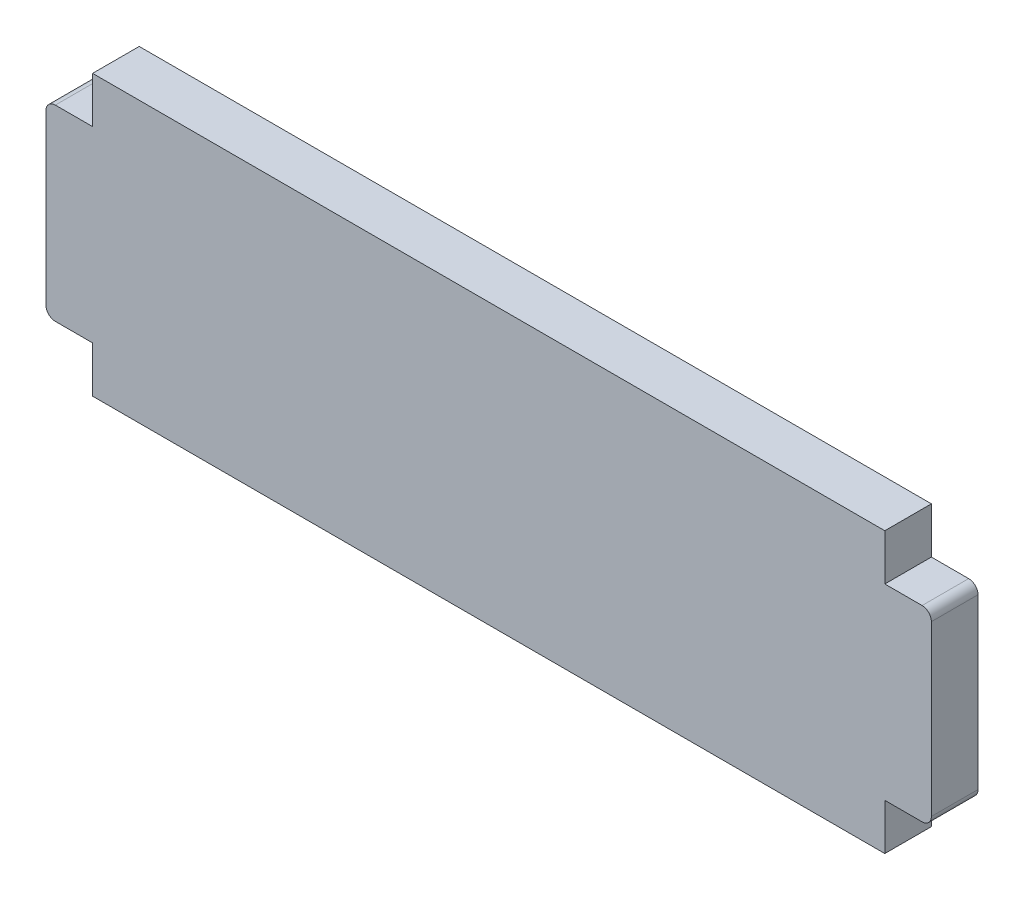
ISO-10303-21;
HEADER;
FILE_DESCRIPTION(('STEP AP214'),'2;1');
FILE_NAME('part.step','',(''),(''),'','','');
FILE_SCHEMA(('AUTOMOTIVE_DESIGN { 1 0 10303 214 1 1 1 1 }'));
ENDSEC;
DATA;
#1=APPLICATION_CONTEXT('core data for automotive mechanical design processes');
#2=APPLICATION_PROTOCOL_DEFINITION('international standard','automotive_design',2000,#1);
#3=PRODUCT_CONTEXT('',#1,'mechanical');
#4=PRODUCT('Part','Part','',(#3));
#5=PRODUCT_RELATED_PRODUCT_CATEGORY('part','',(#4));
#6=PRODUCT_DEFINITION_FORMATION('','',#4);
#7=PRODUCT_DEFINITION_CONTEXT('part definition',#1,'design');
#8=PRODUCT_DEFINITION('design','',#6,#7);
#9=PRODUCT_DEFINITION_SHAPE('','',#8);
#10=(LENGTH_UNIT() NAMED_UNIT(*) SI_UNIT(.MILLI.,.METRE.));
#11=(NAMED_UNIT(*) PLANE_ANGLE_UNIT() SI_UNIT($,.RADIAN.));
#12=(NAMED_UNIT(*) SI_UNIT($,.STERADIAN.) SOLID_ANGLE_UNIT());
#13=UNCERTAINTY_MEASURE_WITH_UNIT(LENGTH_MEASURE(1.E-05),#10,'distance_accuracy_value','');
#14=(GEOMETRIC_REPRESENTATION_CONTEXT(3) GLOBAL_UNCERTAINTY_ASSIGNED_CONTEXT((#13)) GLOBAL_UNIT_ASSIGNED_CONTEXT((#10,
#11,#12)) REPRESENTATION_CONTEXT('',''));
#15=CARTESIAN_POINT('',(0.,0.,0.));
#16=DIRECTION('',(0.,0.,1.));
#17=DIRECTION('',(1.,0.,0.));
#18=AXIS2_PLACEMENT_3D('',#15,#16,#17);
#19=CARTESIAN_POINT('',(0.,0.,5.));
#20=DIRECTION('',(1.,0.,0.));
#21=DIRECTION('',(0.,1.,0.));
#22=AXIS2_PLACEMENT_3D('',#19,#20,#21);
#23=PLANE('',#22);
#24=DIRECTION('',(0.,-1.,0.));
#25=VECTOR('',#24,1.);
#26=CARTESIAN_POINT('',(0.,0.,0.));
#27=LINE('',#26,#25);
#28=CARTESIAN_POINT('',(0.,4.95,0.));
#29=VERTEX_POINT('',#28);
#30=CARTESIAN_POINT('',(0.,0.,0.));
#31=VERTEX_POINT('',#30);
#32=EDGE_CURVE('E179',#29,#31,#27,.T.);
#33=ORIENTED_EDGE('',*,*,#32,.T.);
#34=DIRECTION('',(0.,0.,-1.));
#35=VECTOR('',#34,1.);
#36=CARTESIAN_POINT('',(0.,0.,5.));
#37=LINE('',#36,#35);
#38=CARTESIAN_POINT('',(0.,0.,5.));
#39=VERTEX_POINT('',#38);
#40=EDGE_CURVE('E160',#39,#31,#37,.T.);
#41=ORIENTED_EDGE('',*,*,#40,.F.);
#42=DIRECTION('',(0.,-1.,0.));
#43=VECTOR('',#42,1.);
#44=CARTESIAN_POINT('',(0.,0.,5.));
#45=LINE('',#44,#43);
#46=CARTESIAN_POINT('',(0.,4.95,5.));
#47=VERTEX_POINT('',#46);
#48=EDGE_CURVE('E166',#47,#39,#45,.T.);
#49=ORIENTED_EDGE('',*,*,#48,.F.);
#50=DIRECTION('',(0.,0.,-1.));
#51=VECTOR('',#50,1.);
#52=CARTESIAN_POINT('',(0.,4.95,5.));
#53=LINE('',#52,#51);
#54=EDGE_CURVE('E260',#47,#29,#53,.T.);
#55=ORIENTED_EDGE('',*,*,#54,.T.);
#56=EDGE_LOOP('',(#33,#41,#49,#55));
#57=FACE_BOUND('',#56,.T.);
#58=ADVANCED_FACE('F40',(#57),#23,.F.);
#59=CARTESIAN_POINT('',(0.,0.,5.));
#60=DIRECTION('',(0.,1.,0.));
#61=DIRECTION('',(0.,0.,1.));
#62=AXIS2_PLACEMENT_3D('',#59,#60,#61);
#63=PLANE('',#62);
#64=DIRECTION('',(1.,0.,0.));
#65=VECTOR('',#64,1.);
#66=CARTESIAN_POINT('',(0.,0.,0.));
#67=LINE('',#66,#65);
#68=CARTESIAN_POINT('',(85.,0.,0.));
#69=VERTEX_POINT('',#68);
#70=EDGE_CURVE('E275',#31,#69,#67,.T.);
#71=ORIENTED_EDGE('',*,*,#70,.T.);
#72=DIRECTION('',(0.,0.,-1.));
#73=VECTOR('',#72,1.);
#74=CARTESIAN_POINT('',(85.,0.,5.));
#75=LINE('',#74,#73);
#76=CARTESIAN_POINT('',(85.,0.,5.));
#77=VERTEX_POINT('',#76);
#78=EDGE_CURVE('E163',#77,#69,#75,.T.);
#79=ORIENTED_EDGE('',*,*,#78,.F.);
#80=DIRECTION('',(1.,0.,0.));
#81=VECTOR('',#80,1.);
#82=CARTESIAN_POINT('',(0.,0.,5.));
#83=LINE('',#82,#81);
#84=EDGE_CURVE('E156',#39,#77,#83,.T.);
#85=ORIENTED_EDGE('',*,*,#84,.F.);
#86=ORIENTED_EDGE('',*,*,#40,.T.);
#87=EDGE_LOOP('',(#71,#79,#85,#86));
#88=FACE_BOUND('',#87,.T.);
#89=ADVANCED_FACE('F158',(#88),#63,.F.);
#90=CARTESIAN_POINT('',(85.,0.,5.));
#91=DIRECTION('',(-1.,0.,0.));
#92=DIRECTION('',(0.,0.,1.));
#93=AXIS2_PLACEMENT_3D('',#90,#91,#92);
#94=PLANE('',#93);
#95=DIRECTION('',(0.,1.,0.));
#96=VECTOR('',#95,1.);
#97=CARTESIAN_POINT('',(85.,0.,0.));
#98=LINE('',#97,#96);
#99=CARTESIAN_POINT('',(85.,4.95,0.));
#100=VERTEX_POINT('',#99);
#101=EDGE_CURVE('E245',#69,#100,#98,.T.);
#102=ORIENTED_EDGE('',*,*,#101,.T.);
#103=DIRECTION('',(0.,0.,-1.));
#104=VECTOR('',#103,1.);
#105=CARTESIAN_POINT('',(85.,4.95,5.));
#106=LINE('',#105,#104);
#107=CARTESIAN_POINT('',(85.,4.95,5.));
#108=VERTEX_POINT('',#107);
#109=EDGE_CURVE('E185',#108,#100,#106,.T.);
#110=ORIENTED_EDGE('',*,*,#109,.F.);
#111=DIRECTION('',(0.,1.,0.));
#112=VECTOR('',#111,1.);
#113=CARTESIAN_POINT('',(85.,0.,5.));
#114=LINE('',#113,#112);
#115=EDGE_CURVE('E165',#77,#108,#114,.T.);
#116=ORIENTED_EDGE('',*,*,#115,.F.);
#117=ORIENTED_EDGE('',*,*,#78,.T.);
#118=EDGE_LOOP('',(#102,#110,#116,#117));
#119=FACE_BOUND('',#118,.T.);
#120=ADVANCED_FACE('F332',(#119),#94,.F.);
#121=CARTESIAN_POINT('',(85.,4.95,5.));
#122=DIRECTION('',(0.,1.,0.));
#123=DIRECTION('',(0.,0.,1.));
#124=AXIS2_PLACEMENT_3D('',#121,#122,#123);
#125=PLANE('',#124);
#126=DIRECTION('',(1.,0.,0.));
#127=VECTOR('',#126,1.);
#128=CARTESIAN_POINT('',(85.,4.95,0.));
#129=LINE('',#128,#127);
#130=CARTESIAN_POINT('',(89.,4.95,0.));
#131=VERTEX_POINT('',#130);
#132=EDGE_CURVE('E222',#100,#131,#129,.T.);
#133=ORIENTED_EDGE('',*,*,#132,.T.);
#134=DIRECTION('',(0.,0.,-1.));
#135=VECTOR('',#134,1.);
#136=CARTESIAN_POINT('',(89.,4.95,5.));
#137=LINE('',#136,#135);
#138=CARTESIAN_POINT('',(89.,4.95,5.));
#139=VERTEX_POINT('',#138);
#140=EDGE_CURVE('E48',#131,#139,#137,.F.);
#141=ORIENTED_EDGE('',*,*,#140,.T.);
#142=DIRECTION('',(1.,0.,0.));
#143=VECTOR('',#142,1.);
#144=CARTESIAN_POINT('',(85.,4.95,5.));
#145=LINE('',#144,#143);
#146=EDGE_CURVE('E220',#108,#139,#145,.T.);
#147=ORIENTED_EDGE('',*,*,#146,.F.);
#148=ORIENTED_EDGE('',*,*,#109,.T.);
#149=EDGE_LOOP('',(#133,#141,#147,#148));
#150=FACE_BOUND('',#149,.T.);
#151=ADVANCED_FACE('F218',(#150),#125,.F.);
#152=CARTESIAN_POINT('',(90.,25.05,5.));
#153=DIRECTION('',(-1.,0.,0.));
#154=DIRECTION('',(0.,0.,1.));
#155=AXIS2_PLACEMENT_3D('',#152,#153,#154);
#156=PLANE('',#155);
#157=DIRECTION('',(0.,1.,0.));
#158=VECTOR('',#157,1.);
#159=CARTESIAN_POINT('',(90.,25.05,5.));
#160=LINE('',#159,#158);
#161=CARTESIAN_POINT('',(90.,5.95,5.));
#162=VERTEX_POINT('',#161);
#163=CARTESIAN_POINT('',(90.,24.05,5.));
#164=VERTEX_POINT('',#163);
#165=EDGE_CURVE('E227',#162,#164,#160,.T.);
#166=ORIENTED_EDGE('',*,*,#165,.F.);
#167=DIRECTION('',(0.,0.,-1.));
#168=VECTOR('',#167,1.);
#169=CARTESIAN_POINT('',(90.,5.95,5.));
#170=LINE('',#169,#168);
#171=CARTESIAN_POINT('',(90.,5.95,0.));
#172=VERTEX_POINT('',#171);
#173=EDGE_CURVE('E211',#162,#172,#170,.T.);
#174=ORIENTED_EDGE('',*,*,#173,.T.);
#175=DIRECTION('',(0.,1.,0.));
#176=VECTOR('',#175,1.);
#177=CARTESIAN_POINT('',(90.,25.05,0.));
#178=LINE('',#177,#176);
#179=CARTESIAN_POINT('',(90.,24.05,0.));
#180=VERTEX_POINT('',#179);
#181=EDGE_CURVE('E235',#172,#180,#178,.T.);
#182=ORIENTED_EDGE('',*,*,#181,.T.);
#183=DIRECTION('',(0.,0.,-1.));
#184=VECTOR('',#183,1.);
#185=CARTESIAN_POINT('',(90.,24.05,5.));
#186=LINE('',#185,#184);
#187=EDGE_CURVE('E209',#180,#164,#186,.F.);
#188=ORIENTED_EDGE('',*,*,#187,.T.);
#189=EDGE_LOOP('',(#166,#174,#182,#188));
#190=FACE_BOUND('',#189,.T.);
#191=ADVANCED_FACE('F234',(#190),#156,.F.);
#192=CARTESIAN_POINT('',(85.,25.05,5.));
#193=DIRECTION('',(0.,-1.,0.));
#194=DIRECTION('',(0.,0.,-1.));
#195=AXIS2_PLACEMENT_3D('',#192,#193,#194);
#196=PLANE('',#195);
#197=DIRECTION('',(-1.,0.,0.));
#198=VECTOR('',#197,1.);
#199=CARTESIAN_POINT('',(85.,25.05,5.));
#200=LINE('',#199,#198);
#201=CARTESIAN_POINT('',(89.,25.05,5.));
#202=VERTEX_POINT('',#201);
#203=CARTESIAN_POINT('',(85.,25.05,5.));
#204=VERTEX_POINT('',#203);
#205=EDGE_CURVE('E290',#202,#204,#200,.T.);
#206=ORIENTED_EDGE('',*,*,#205,.F.);
#207=DIRECTION('',(0.,0.,-1.));
#208=VECTOR('',#207,1.);
#209=CARTESIAN_POINT('',(89.,25.05,5.));
#210=LINE('',#209,#208);
#211=CARTESIAN_POINT('',(89.,25.05,0.));
#212=VERTEX_POINT('',#211);
#213=EDGE_CURVE('E11',#202,#212,#210,.T.);
#214=ORIENTED_EDGE('',*,*,#213,.T.);
#215=DIRECTION('',(-1.,0.,0.));
#216=VECTOR('',#215,1.);
#217=CARTESIAN_POINT('',(85.,25.05,0.));
#218=LINE('',#217,#216);
#219=CARTESIAN_POINT('',(85.,25.05,0.));
#220=VERTEX_POINT('',#219);
#221=EDGE_CURVE('E241',#212,#220,#218,.T.);
#222=ORIENTED_EDGE('',*,*,#221,.T.);
#223=DIRECTION('',(0.,0.,-1.));
#224=VECTOR('',#223,1.);
#225=CARTESIAN_POINT('',(85.,25.05,5.));
#226=LINE('',#225,#224);
#227=EDGE_CURVE('E271',#204,#220,#226,.T.);
#228=ORIENTED_EDGE('',*,*,#227,.F.);
#229=EDGE_LOOP('',(#206,#214,#222,#228));
#230=FACE_BOUND('',#229,.T.);
#231=ADVANCED_FACE('F296',(#230),#196,.F.);
#232=CARTESIAN_POINT('',(85.,25.05,5.));
#233=DIRECTION('',(-1.,0.,0.));
#234=DIRECTION('',(0.,0.,1.));
#235=AXIS2_PLACEMENT_3D('',#232,#233,#234);
#236=PLANE('',#235);
#237=DIRECTION('',(0.,1.,0.));
#238=VECTOR('',#237,1.);
#239=CARTESIAN_POINT('',(85.,25.05,0.));
#240=LINE('',#239,#238);
#241=CARTESIAN_POINT('',(85.,30.,0.));
#242=VERTEX_POINT('',#241);
#243=EDGE_CURVE('E243',#220,#242,#240,.T.);
#244=ORIENTED_EDGE('',*,*,#243,.T.);
#245=DIRECTION('',(0.,0.,-1.));
#246=VECTOR('',#245,1.);
#247=CARTESIAN_POINT('',(85.,30.,5.));
#248=LINE('',#247,#246);
#249=CARTESIAN_POINT('',(85.,30.,5.));
#250=VERTEX_POINT('',#249);
#251=EDGE_CURVE('E268',#250,#242,#248,.T.);
#252=ORIENTED_EDGE('',*,*,#251,.F.);
#253=DIRECTION('',(0.,1.,0.));
#254=VECTOR('',#253,1.);
#255=CARTESIAN_POINT('',(85.,25.05,5.));
#256=LINE('',#255,#254);
#257=EDGE_CURVE('E288',#204,#250,#256,.T.);
#258=ORIENTED_EDGE('',*,*,#257,.F.);
#259=ORIENTED_EDGE('',*,*,#227,.T.);
#260=EDGE_LOOP('',(#244,#252,#258,#259));
#261=FACE_BOUND('',#260,.T.);
#262=ADVANCED_FACE('F303',(#261),#236,.F.);
#263=CARTESIAN_POINT('',(0.,30.,5.));
#264=DIRECTION('',(0.,-1.,0.));
#265=DIRECTION('',(0.,0.,-1.));
#266=AXIS2_PLACEMENT_3D('',#263,#264,#265);
#267=PLANE('',#266);
#268=DIRECTION('',(-1.,0.,0.));
#269=VECTOR('',#268,1.);
#270=CARTESIAN_POINT('',(0.,30.,0.));
#271=LINE('',#270,#269);
#272=CARTESIAN_POINT('',(0.,30.,0.));
#273=VERTEX_POINT('',#272);
#274=EDGE_CURVE('E250',#242,#273,#271,.T.);
#275=ORIENTED_EDGE('',*,*,#274,.T.);
#276=DIRECTION('',(0.,0.,-1.));
#277=VECTOR('',#276,1.);
#278=CARTESIAN_POINT('',(0.,30.,5.));
#279=LINE('',#278,#277);
#280=CARTESIAN_POINT('',(0.,30.,5.));
#281=VERTEX_POINT('',#280);
#282=EDGE_CURVE('E265',#281,#273,#279,.T.);
#283=ORIENTED_EDGE('',*,*,#282,.F.);
#284=DIRECTION('',(-1.,0.,0.));
#285=VECTOR('',#284,1.);
#286=CARTESIAN_POINT('',(0.,30.,5.));
#287=LINE('',#286,#285);
#288=EDGE_CURVE('E286',#250,#281,#287,.T.);
#289=ORIENTED_EDGE('',*,*,#288,.F.);
#290=ORIENTED_EDGE('',*,*,#251,.T.);
#291=EDGE_LOOP('',(#275,#283,#289,#290));
#292=FACE_BOUND('',#291,.T.);
#293=ADVANCED_FACE('F307',(#292),#267,.F.);
#294=CARTESIAN_POINT('',(0.,25.05,5.));
#295=DIRECTION('',(1.,0.,0.));
#296=DIRECTION('',(0.,0.,-1.));
#297=AXIS2_PLACEMENT_3D('',#294,#295,#296);
#298=PLANE('',#297);
#299=DIRECTION('',(0.,-1.,0.));
#300=VECTOR('',#299,1.);
#301=CARTESIAN_POINT('',(0.,25.05,0.));
#302=LINE('',#301,#300);
#303=CARTESIAN_POINT('',(0.,25.05,0.));
#304=VERTEX_POINT('',#303);
#305=EDGE_CURVE('E252',#273,#304,#302,.T.);
#306=ORIENTED_EDGE('',*,*,#305,.T.);
#307=DIRECTION('',(0.,0.,-1.));
#308=VECTOR('',#307,1.);
#309=CARTESIAN_POINT('',(0.,25.05,5.));
#310=LINE('',#309,#308);
#311=CARTESIAN_POINT('',(0.,25.05,5.));
#312=VERTEX_POINT('',#311);
#313=EDGE_CURVE('E262',#312,#304,#310,.T.);
#314=ORIENTED_EDGE('',*,*,#313,.F.);
#315=DIRECTION('',(0.,-1.,0.));
#316=VECTOR('',#315,1.);
#317=CARTESIAN_POINT('',(0.,25.05,5.));
#318=LINE('',#317,#316);
#319=EDGE_CURVE('E284',#281,#312,#318,.T.);
#320=ORIENTED_EDGE('',*,*,#319,.F.);
#321=ORIENTED_EDGE('',*,*,#282,.T.);
#322=EDGE_LOOP('',(#306,#314,#320,#321));
#323=FACE_BOUND('',#322,.T.);
#324=ADVANCED_FACE('F313',(#323),#298,.F.);
#325=CARTESIAN_POINT('',(0.,25.05,5.));
#326=DIRECTION('',(0.,-1.,0.));
#327=DIRECTION('',(0.,0.,-1.));
#328=AXIS2_PLACEMENT_3D('',#325,#326,#327);
#329=PLANE('',#328);
#330=DIRECTION('',(-1.,0.,0.));
#331=VECTOR('',#330,1.);
#332=CARTESIAN_POINT('',(0.,25.05,0.));
#333=LINE('',#332,#331);
#334=CARTESIAN_POINT('',(-4.,25.05,0.));
#335=VERTEX_POINT('',#334);
#336=EDGE_CURVE('E254',#304,#335,#333,.T.);
#337=ORIENTED_EDGE('',*,*,#336,.T.);
#338=DIRECTION('',(0.,0.,-1.));
#339=VECTOR('',#338,1.);
#340=CARTESIAN_POINT('',(-4.,25.05,5.));
#341=LINE('',#340,#339);
#342=CARTESIAN_POINT('',(-4.,25.05,5.));
#343=VERTEX_POINT('',#342);
#344=EDGE_CURVE('E55',#335,#343,#341,.F.);
#345=ORIENTED_EDGE('',*,*,#344,.T.);
#346=DIRECTION('',(-1.,0.,0.));
#347=VECTOR('',#346,1.);
#348=CARTESIAN_POINT('',(0.,25.05,5.));
#349=LINE('',#348,#347);
#350=EDGE_CURVE('E282',#312,#343,#349,.T.);
#351=ORIENTED_EDGE('',*,*,#350,.F.);
#352=ORIENTED_EDGE('',*,*,#313,.T.);
#353=EDGE_LOOP('',(#337,#345,#351,#352));
#354=FACE_BOUND('',#353,.T.);
#355=ADVANCED_FACE('F315',(#354),#329,.F.);
#356=CARTESIAN_POINT('',(-5.,25.05,5.));
#357=DIRECTION('',(1.,0.,0.));
#358=DIRECTION('',(0.,1.,0.));
#359=AXIS2_PLACEMENT_3D('',#356,#357,#358);
#360=PLANE('',#359);
#361=DIRECTION('',(0.,-1.,0.));
#362=VECTOR('',#361,1.);
#363=CARTESIAN_POINT('',(-5.,25.05,0.));
#364=LINE('',#363,#362);
#365=CARTESIAN_POINT('',(-5.,24.05,0.));
#366=VERTEX_POINT('',#365);
#367=CARTESIAN_POINT('',(-5.,5.95,0.));
#368=VERTEX_POINT('',#367);
#369=EDGE_CURVE('E256',#366,#368,#364,.T.);
#370=ORIENTED_EDGE('',*,*,#369,.T.);
#371=DIRECTION('',(0.,0.,-1.));
#372=VECTOR('',#371,1.);
#373=CARTESIAN_POINT('',(-5.,5.95,5.));
#374=LINE('',#373,#372);
#375=CARTESIAN_POINT('',(-5.,5.95,5.));
#376=VERTEX_POINT('',#375);
#377=EDGE_CURVE('E199',#368,#376,#374,.F.);
#378=ORIENTED_EDGE('',*,*,#377,.T.);
#379=DIRECTION('',(0.,-1.,0.));
#380=VECTOR('',#379,1.);
#381=CARTESIAN_POINT('',(-5.,25.05,5.));
#382=LINE('',#381,#380);
#383=CARTESIAN_POINT('',(-5.,24.05,5.));
#384=VERTEX_POINT('',#383);
#385=EDGE_CURVE('E280',#384,#376,#382,.T.);
#386=ORIENTED_EDGE('',*,*,#385,.F.);
#387=DIRECTION('',(0.,0.,-1.));
#388=VECTOR('',#387,1.);
#389=CARTESIAN_POINT('',(-5.,24.05,5.));
#390=LINE('',#389,#388);
#391=EDGE_CURVE('E196',#384,#366,#390,.T.);
#392=ORIENTED_EDGE('',*,*,#391,.T.);
#393=EDGE_LOOP('',(#370,#378,#386,#392));
#394=FACE_BOUND('',#393,.T.);
#395=ADVANCED_FACE('F317',(#394),#360,.F.);
#396=CARTESIAN_POINT('',(0.,4.95,5.));
#397=DIRECTION('',(0.,1.,0.));
#398=DIRECTION('',(-1.,0.,0.));
#399=AXIS2_PLACEMENT_3D('',#396,#397,#398);
#400=PLANE('',#399);
#401=DIRECTION('',(1.,0.,0.));
#402=VECTOR('',#401,1.);
#403=CARTESIAN_POINT('',(0.,4.95,5.));
#404=LINE('',#403,#402);
#405=CARTESIAN_POINT('',(-4.,4.95,5.));
#406=VERTEX_POINT('',#405);
#407=EDGE_CURVE('E172',#406,#47,#404,.T.);
#408=ORIENTED_EDGE('',*,*,#407,.F.);
#409=DIRECTION('',(0.,0.,-1.));
#410=VECTOR('',#409,1.);
#411=CARTESIAN_POINT('',(-4.,4.95,5.));
#412=LINE('',#411,#410);
#413=CARTESIAN_POINT('',(-4.,4.95,0.));
#414=VERTEX_POINT('',#413);
#415=EDGE_CURVE('E180',#406,#414,#412,.T.);
#416=ORIENTED_EDGE('',*,*,#415,.T.);
#417=DIRECTION('',(1.,0.,0.));
#418=VECTOR('',#417,1.);
#419=CARTESIAN_POINT('',(0.,4.95,0.));
#420=LINE('',#419,#418);
#421=EDGE_CURVE('E176',#414,#29,#420,.T.);
#422=ORIENTED_EDGE('',*,*,#421,.T.);
#423=ORIENTED_EDGE('',*,*,#54,.F.);
#424=EDGE_LOOP('',(#408,#416,#422,#423));
#425=FACE_BOUND('',#424,.T.);
#426=ADVANCED_FACE('F323',(#425),#400,.F.);
#427=CARTESIAN_POINT('',(0.,0.,5.));
#428=DIRECTION('',(0.,0.,1.));
#429=DIRECTION('',(1.,0.,0.));
#430=AXIS2_PLACEMENT_3D('',#427,#428,#429);
#431=PLANE('',#430);
#432=ORIENTED_EDGE('',*,*,#385,.T.);
#433=CARTESIAN_POINT('',(-4.,5.95,5.));
#434=DIRECTION('',(0.,0.,1.));
#435=DIRECTION('',(1.,0.,0.));
#436=AXIS2_PLACEMENT_3D('',#433,#434,#435);
#437=CIRCLE('',#436,1.);
#438=EDGE_CURVE('E206',#376,#406,#437,.T.);
#439=ORIENTED_EDGE('',*,*,#438,.T.);
#440=ORIENTED_EDGE('',*,*,#407,.T.);
#441=ORIENTED_EDGE('',*,*,#48,.T.);
#442=ORIENTED_EDGE('',*,*,#84,.T.);
#443=ORIENTED_EDGE('',*,*,#115,.T.);
#444=ORIENTED_EDGE('',*,*,#146,.T.);
#445=CARTESIAN_POINT('',(89.,5.95,5.));
#446=DIRECTION('',(0.,0.,1.));
#447=DIRECTION('',(1.,0.,0.));
#448=AXIS2_PLACEMENT_3D('',#445,#446,#447);
#449=CIRCLE('',#448,1.);
#450=EDGE_CURVE('E202',#139,#162,#449,.T.);
#451=ORIENTED_EDGE('',*,*,#450,.T.);
#452=ORIENTED_EDGE('',*,*,#165,.T.);
#453=CARTESIAN_POINT('',(89.,24.05,5.));
#454=DIRECTION('',(0.,0.,1.));
#455=DIRECTION('',(1.,0.,0.));
#456=AXIS2_PLACEMENT_3D('',#453,#454,#455);
#457=CIRCLE('',#456,1.);
#458=EDGE_CURVE('E63',#164,#202,#457,.T.);
#459=ORIENTED_EDGE('',*,*,#458,.T.);
#460=ORIENTED_EDGE('',*,*,#205,.T.);
#461=ORIENTED_EDGE('',*,*,#257,.T.);
#462=ORIENTED_EDGE('',*,*,#288,.T.);
#463=ORIENTED_EDGE('',*,*,#319,.T.);
#464=ORIENTED_EDGE('',*,*,#350,.T.);
#465=CARTESIAN_POINT('',(-4.,24.05,5.));
#466=DIRECTION('',(0.,0.,1.));
#467=DIRECTION('',(1.,0.,0.));
#468=AXIS2_PLACEMENT_3D('',#465,#466,#467);
#469=CIRCLE('',#468,1.);
#470=EDGE_CURVE('E204',#343,#384,#469,.T.);
#471=ORIENTED_EDGE('',*,*,#470,.T.);
#472=EDGE_LOOP('',(#432,#439,#440,#441,#442,#443,#444,#451,#452,#459,#460,#461,#462,#463,#464,#471));
#473=FACE_BOUND('',#472,.T.);
#474=ADVANCED_FACE('F170',(#473),#431,.T.);
#475=CARTESIAN_POINT('',(0.,0.,0.));
#476=DIRECTION('',(0.,0.,1.));
#477=DIRECTION('',(1.,0.,0.));
#478=AXIS2_PLACEMENT_3D('',#475,#476,#477);
#479=PLANE('',#478);
#480=ORIENTED_EDGE('',*,*,#421,.F.);
#481=CARTESIAN_POINT('',(-4.,5.95,0.));
#482=DIRECTION('',(0.,0.,1.));
#483=DIRECTION('',(1.,0.,0.));
#484=AXIS2_PLACEMENT_3D('',#481,#482,#483);
#485=CIRCLE('',#484,1.);
#486=EDGE_CURVE('E194',#414,#368,#485,.F.);
#487=ORIENTED_EDGE('',*,*,#486,.T.);
#488=ORIENTED_EDGE('',*,*,#369,.F.);
#489=CARTESIAN_POINT('',(-4.,24.05,0.));
#490=DIRECTION('',(0.,0.,1.));
#491=DIRECTION('',(1.,0.,0.));
#492=AXIS2_PLACEMENT_3D('',#489,#490,#491);
#493=CIRCLE('',#492,1.);
#494=EDGE_CURVE('E192',#366,#335,#493,.F.);
#495=ORIENTED_EDGE('',*,*,#494,.T.);
#496=ORIENTED_EDGE('',*,*,#336,.F.);
#497=ORIENTED_EDGE('',*,*,#305,.F.);
#498=ORIENTED_EDGE('',*,*,#274,.F.);
#499=ORIENTED_EDGE('',*,*,#243,.F.);
#500=ORIENTED_EDGE('',*,*,#221,.F.);
#501=CARTESIAN_POINT('',(89.,24.05,0.));
#502=DIRECTION('',(0.,0.,1.));
#503=DIRECTION('',(1.,0.,0.));
#504=AXIS2_PLACEMENT_3D('',#501,#502,#503);
#505=CIRCLE('',#504,1.);
#506=EDGE_CURVE('E183',#212,#180,#505,.F.);
#507=ORIENTED_EDGE('',*,*,#506,.T.);
#508=ORIENTED_EDGE('',*,*,#181,.F.);
#509=CARTESIAN_POINT('',(89.,5.95,0.));
#510=DIRECTION('',(0.,0.,1.));
#511=DIRECTION('',(1.,0.,0.));
#512=AXIS2_PLACEMENT_3D('',#509,#510,#511);
#513=CIRCLE('',#512,1.);
#514=EDGE_CURVE('E190',#172,#131,#513,.F.);
#515=ORIENTED_EDGE('',*,*,#514,.T.);
#516=ORIENTED_EDGE('',*,*,#132,.F.);
#517=ORIENTED_EDGE('',*,*,#101,.F.);
#518=ORIENTED_EDGE('',*,*,#70,.F.);
#519=ORIENTED_EDGE('',*,*,#32,.F.);
#520=EDGE_LOOP('',(#480,#487,#488,#495,#496,#497,#498,#499,#500,#507,#508,#515,#516,#517,#518,#519));
#521=FACE_BOUND('',#520,.T.);
#522=ADVANCED_FACE('F239',(#521),#479,.F.);
#523=CARTESIAN_POINT('',(-4.,5.95,5.));
#524=DIRECTION('',(0.,0.,-1.));
#525=DIRECTION('',(-1.,0.,0.));
#526=AXIS2_PLACEMENT_3D('',#523,#524,#525);
#527=CYLINDRICAL_SURFACE('',#526,1.);
#528=ORIENTED_EDGE('',*,*,#438,.F.);
#529=ORIENTED_EDGE('',*,*,#377,.F.);
#530=ORIENTED_EDGE('',*,*,#486,.F.);
#531=ORIENTED_EDGE('',*,*,#415,.F.);
#532=EDGE_LOOP('',(#528,#529,#530,#531));
#533=FACE_BOUND('',#532,.T.);
#534=ADVANCED_FACE('F336',(#533),#527,.T.);
#535=CARTESIAN_POINT('',(-4.,24.05,5.));
#536=DIRECTION('',(0.,0.,-1.));
#537=DIRECTION('',(-1.,0.,0.));
#538=AXIS2_PLACEMENT_3D('',#535,#536,#537);
#539=CYLINDRICAL_SURFACE('',#538,1.);
#540=ORIENTED_EDGE('',*,*,#470,.F.);
#541=ORIENTED_EDGE('',*,*,#344,.F.);
#542=ORIENTED_EDGE('',*,*,#494,.F.);
#543=ORIENTED_EDGE('',*,*,#391,.F.);
#544=EDGE_LOOP('',(#540,#541,#542,#543));
#545=FACE_BOUND('',#544,.T.);
#546=ADVANCED_FACE('F339',(#545),#539,.T.);
#547=CARTESIAN_POINT('',(89.,5.95,5.));
#548=DIRECTION('',(0.,0.,-1.));
#549=DIRECTION('',(-1.,0.,0.));
#550=AXIS2_PLACEMENT_3D('',#547,#548,#549);
#551=CYLINDRICAL_SURFACE('',#550,1.);
#552=ORIENTED_EDGE('',*,*,#450,.F.);
#553=ORIENTED_EDGE('',*,*,#140,.F.);
#554=ORIENTED_EDGE('',*,*,#514,.F.);
#555=ORIENTED_EDGE('',*,*,#173,.F.);
#556=EDGE_LOOP('',(#552,#553,#554,#555));
#557=FACE_BOUND('',#556,.T.);
#558=ADVANCED_FACE('F230',(#557),#551,.T.);
#559=CARTESIAN_POINT('',(89.,24.05,5.));
#560=DIRECTION('',(0.,0.,-1.));
#561=DIRECTION('',(-1.,0.,0.));
#562=AXIS2_PLACEMENT_3D('',#559,#560,#561);
#563=CYLINDRICAL_SURFACE('',#562,1.);
#564=ORIENTED_EDGE('',*,*,#458,.F.);
#565=ORIENTED_EDGE('',*,*,#187,.F.);
#566=ORIENTED_EDGE('',*,*,#506,.F.);
#567=ORIENTED_EDGE('',*,*,#213,.F.);
#568=EDGE_LOOP('',(#564,#565,#566,#567));
#569=FACE_BOUND('',#568,.T.);
#570=ADVANCED_FACE('F42',(#569),#563,.T.);
#571=CLOSED_SHELL('',(#58,#89,#120,#151,#191,#231,#262,#293,#324,#355,#395,#426,#474,#522,#534,
#546,#558,#570));
#572=MANIFOLD_SOLID_BREP('B2',#571);
#573=ADVANCED_BREP_SHAPE_REPRESENTATION('',(#18,#572),#14);
#574=SHAPE_DEFINITION_REPRESENTATION(#9,#573);
ENDSEC;
END-ISO-10303-21;
